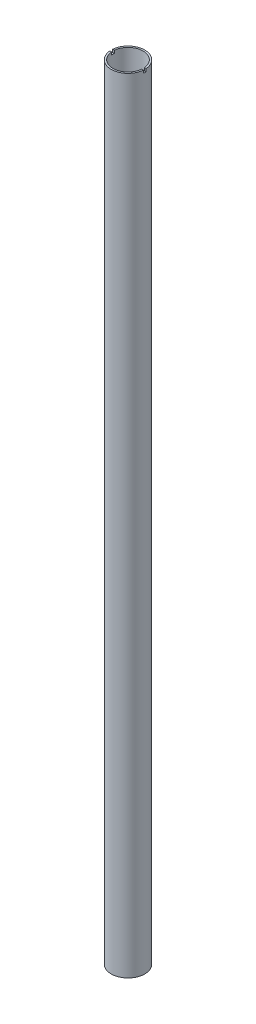
ISO-10303-21;
HEADER;
FILE_DESCRIPTION(('STEP AP214'),'2;1');
FILE_NAME('part.step','',(''),(''),'','','');
FILE_SCHEMA(('AUTOMOTIVE_DESIGN { 1 0 10303 214 1 1 1 1 }'));
ENDSEC;
DATA;
#1=APPLICATION_CONTEXT('core data for automotive mechanical design processes');
#2=APPLICATION_PROTOCOL_DEFINITION('international standard','automotive_design',2000,#1);
#3=PRODUCT_CONTEXT('',#1,'mechanical');
#4=PRODUCT('Part','Part','',(#3));
#5=PRODUCT_RELATED_PRODUCT_CATEGORY('part','',(#4));
#6=PRODUCT_DEFINITION_FORMATION('','',#4);
#7=PRODUCT_DEFINITION_CONTEXT('part definition',#1,'design');
#8=PRODUCT_DEFINITION('design','',#6,#7);
#9=PRODUCT_DEFINITION_SHAPE('','',#8);
#10=(LENGTH_UNIT() NAMED_UNIT(*) SI_UNIT(.MILLI.,.METRE.));
#11=(NAMED_UNIT(*) PLANE_ANGLE_UNIT() SI_UNIT($,.RADIAN.));
#12=(NAMED_UNIT(*) SI_UNIT($,.STERADIAN.) SOLID_ANGLE_UNIT());
#13=UNCERTAINTY_MEASURE_WITH_UNIT(LENGTH_MEASURE(1.E-05),#10,'distance_accuracy_value','');
#14=(GEOMETRIC_REPRESENTATION_CONTEXT(3) GLOBAL_UNCERTAINTY_ASSIGNED_CONTEXT((#13)) GLOBAL_UNIT_ASSIGNED_CONTEXT((#10,
#11,#12)) REPRESENTATION_CONTEXT('',''));
#15=CARTESIAN_POINT('',(0.,0.,0.));
#16=DIRECTION('',(0.,0.,1.));
#17=DIRECTION('',(1.,0.,0.));
#18=AXIS2_PLACEMENT_3D('',#15,#16,#17);
#19=CARTESIAN_POINT('',(0.,700.,0.));
#20=DIRECTION('',(0.,1.,0.));
#21=DIRECTION('',(0.,0.,1.));
#22=AXIS2_PLACEMENT_3D('',#19,#20,#21);
#23=PLANE('',#22);
#24=DIRECTION('',(1.,0.,0.));
#25=VECTOR('',#24,1.);
#26=CARTESIAN_POINT('',(-15.,700.,1.25));
#27=LINE('',#26,#25);
#28=CARTESIAN_POINT('',(-14.9478259288767,700.,1.25));
#29=VERTEX_POINT('',#28);
#30=CARTESIAN_POINT('',(-13.4420050587701,700.,1.25));
#31=VERTEX_POINT('',#30);
#32=EDGE_CURVE('E168',#29,#31,#27,.T.);
#33=ORIENTED_EDGE('',*,*,#32,.F.);
#34=CARTESIAN_POINT('',(0.,700.,0.));
#35=DIRECTION('',(0.,1.,0.));
#36=DIRECTION('',(0.,0.,1.));
#37=AXIS2_PLACEMENT_3D('',#34,#35,#36);
#38=CIRCLE('',#37,15.);
#39=CARTESIAN_POINT('',(14.9478259288767,700.,1.25));
#40=VERTEX_POINT('',#39);
#41=EDGE_CURVE('E121',#29,#40,#38,.T.);
#42=ORIENTED_EDGE('',*,*,#41,.T.);
#43=CARTESIAN_POINT('',(13.4420050587701,700.,1.25));
#44=VERTEX_POINT('',#43);
#45=EDGE_CURVE('E114',#44,#40,#27,.T.);
#46=ORIENTED_EDGE('',*,*,#45,.F.);
#47=CARTESIAN_POINT('',(0.,700.,0.));
#48=DIRECTION('',(0.,1.,0.));
#49=DIRECTION('',(0.,0.,1.));
#50=AXIS2_PLACEMENT_3D('',#47,#48,#49);
#51=CIRCLE('',#50,13.5);
#52=EDGE_CURVE('E154',#31,#44,#51,.T.);
#53=ORIENTED_EDGE('',*,*,#52,.F.);
#54=EDGE_LOOP('',(#33,#42,#46,#53));
#55=FACE_BOUND('',#54,.T.);
#56=ADVANCED_FACE('F33',(#55),#23,.T.);
#57=DIRECTION('',(-1.,0.,0.));
#58=VECTOR('',#57,1.);
#59=CARTESIAN_POINT('',(-15.,700.,-1.25));
#60=LINE('',#59,#58);
#61=CARTESIAN_POINT('',(14.9478259288767,700.,-1.25));
#62=VERTEX_POINT('',#61);
#63=CARTESIAN_POINT('',(13.4420050587701,700.,-1.25));
#64=VERTEX_POINT('',#63);
#65=EDGE_CURVE('E99',#62,#64,#60,.T.);
#66=ORIENTED_EDGE('',*,*,#65,.F.);
#67=CARTESIAN_POINT('',(-14.9478259288767,700.,-1.25));
#68=VERTEX_POINT('',#67);
#69=EDGE_CURVE('E111',#62,#68,#38,.T.);
#70=ORIENTED_EDGE('',*,*,#69,.T.);
#71=CARTESIAN_POINT('',(-13.4420050587701,700.,-1.25));
#72=VERTEX_POINT('',#71);
#73=EDGE_CURVE('E115',#72,#68,#60,.T.);
#74=ORIENTED_EDGE('',*,*,#73,.F.);
#75=EDGE_CURVE('E113',#64,#72,#51,.T.);
#76=ORIENTED_EDGE('',*,*,#75,.F.);
#77=EDGE_LOOP('',(#66,#70,#74,#76));
#78=FACE_BOUND('',#77,.T.);
#79=ADVANCED_FACE('F109',(#78),#23,.T.);
#80=CARTESIAN_POINT('',(0.,0.,0.));
#81=DIRECTION('',(0.,1.,0.));
#82=DIRECTION('',(0.,0.,1.));
#83=AXIS2_PLACEMENT_3D('',#80,#81,#82);
#84=PLANE('',#83);
#85=CARTESIAN_POINT('',(0.,0.,0.));
#86=DIRECTION('',(0.,1.,0.));
#87=DIRECTION('',(0.,0.,1.));
#88=AXIS2_PLACEMENT_3D('',#85,#86,#87);
#89=CIRCLE('',#88,15.);
#90=CARTESIAN_POINT('',(0.,0.,15.));
#91=VERTEX_POINT('',#90);
#92=EDGE_CURVE('E127',#91,#91,#89,.T.);
#93=ORIENTED_EDGE('',*,*,#92,.F.);
#94=EDGE_LOOP('',(#93));
#95=FACE_BOUND('',#94,.T.);
#96=CARTESIAN_POINT('',(0.,0.,0.));
#97=DIRECTION('',(0.,1.,0.));
#98=DIRECTION('',(0.,0.,1.));
#99=AXIS2_PLACEMENT_3D('',#96,#97,#98);
#100=CIRCLE('',#99,13.5);
#101=CARTESIAN_POINT('',(0.,0.,13.5));
#102=VERTEX_POINT('',#101);
#103=EDGE_CURVE('E130',#102,#102,#100,.T.);
#104=ORIENTED_EDGE('',*,*,#103,.T.);
#105=EDGE_LOOP('',(#104));
#106=FACE_BOUND('',#105,.T.);
#107=ADVANCED_FACE('F195',(#95,#106),#84,.F.);
#108=CARTESIAN_POINT('',(0.,700.,0.));
#109=DIRECTION('',(0.,-1.,0.));
#110=DIRECTION('',(0.,0.,-1.));
#111=AXIS2_PLACEMENT_3D('',#108,#109,#110);
#112=CYLINDRICAL_SURFACE('',#111,15.);
#113=CARTESIAN_POINT('',(0.,697.5,0.));
#114=DIRECTION('',(0.,-1.,0.));
#115=DIRECTION('',(0.,0.,-1.));
#116=AXIS2_PLACEMENT_3D('',#113,#114,#115);
#117=CIRCLE('',#116,15.);
#118=CARTESIAN_POINT('',(14.9478259288767,697.5,-1.25));
#119=VERTEX_POINT('',#118);
#120=CARTESIAN_POINT('',(14.9478259288767,697.5,1.25));
#121=VERTEX_POINT('',#120);
#122=EDGE_CURVE('E165',#119,#121,#117,.T.);
#123=ORIENTED_EDGE('',*,*,#122,.T.);
#124=DIRECTION('',(0.,-1.,0.));
#125=VECTOR('',#124,1.);
#126=CARTESIAN_POINT('',(14.9478259288767,700.,1.25));
#127=LINE('',#126,#125);
#128=EDGE_CURVE('E103',#121,#40,#127,.F.);
#129=ORIENTED_EDGE('',*,*,#128,.T.);
#130=ORIENTED_EDGE('',*,*,#41,.F.);
#131=DIRECTION('',(0.,-1.,0.));
#132=VECTOR('',#131,1.);
#133=CARTESIAN_POINT('',(-14.9478259288767,700.,1.25));
#134=LINE('',#133,#132);
#135=CARTESIAN_POINT('',(-14.9478259288767,697.5,1.25));
#136=VERTEX_POINT('',#135);
#137=EDGE_CURVE('E159',#29,#136,#134,.T.);
#138=ORIENTED_EDGE('',*,*,#137,.T.);
#139=CARTESIAN_POINT('',(-14.9478259288767,697.5,-1.25));
#140=VERTEX_POINT('',#139);
#141=EDGE_CURVE('E167',#136,#140,#117,.T.);
#142=ORIENTED_EDGE('',*,*,#141,.T.);
#143=DIRECTION('',(0.,-1.,0.));
#144=VECTOR('',#143,1.);
#145=CARTESIAN_POINT('',(-14.9478259288767,700.,-1.25));
#146=LINE('',#145,#144);
#147=EDGE_CURVE('E104',#140,#68,#146,.F.);
#148=ORIENTED_EDGE('',*,*,#147,.T.);
#149=ORIENTED_EDGE('',*,*,#69,.F.);
#150=DIRECTION('',(0.,-1.,0.));
#151=VECTOR('',#150,1.);
#152=CARTESIAN_POINT('',(14.9478259288767,700.,-1.25));
#153=LINE('',#152,#151);
#154=EDGE_CURVE('E96',#62,#119,#153,.T.);
#155=ORIENTED_EDGE('',*,*,#154,.T.);
#156=EDGE_LOOP('',(#123,#129,#130,#138,#142,#148,#149,#155));
#157=FACE_BOUND('',#156,.T.);
#158=ORIENTED_EDGE('',*,*,#92,.T.);
#159=EDGE_LOOP('',(#158));
#160=FACE_BOUND('',#159,.T.);
#161=ADVANCED_FACE('F35',(#157,#160),#112,.T.);
#162=CARTESIAN_POINT('',(0.,700.,0.));
#163=DIRECTION('',(0.,-1.,0.));
#164=DIRECTION('',(0.,0.,-1.));
#165=AXIS2_PLACEMENT_3D('',#162,#163,#164);
#166=CYLINDRICAL_SURFACE('',#165,13.5);
#167=DIRECTION('',(0.,-1.,0.));
#168=VECTOR('',#167,1.);
#169=CARTESIAN_POINT('',(13.4420050587701,700.,1.25));
#170=LINE('',#169,#168);
#171=CARTESIAN_POINT('',(13.4420050587701,697.5,1.25));
#172=VERTEX_POINT('',#171);
#173=EDGE_CURVE('E11',#172,#44,#170,.F.);
#174=ORIENTED_EDGE('',*,*,#173,.F.);
#175=CARTESIAN_POINT('',(0.,697.5,0.));
#176=DIRECTION('',(0.,-1.,0.));
#177=DIRECTION('',(0.,0.,-1.));
#178=AXIS2_PLACEMENT_3D('',#175,#176,#177);
#179=CIRCLE('',#178,13.5);
#180=CARTESIAN_POINT('',(13.4420050587701,697.5,-1.25));
#181=VERTEX_POINT('',#180);
#182=EDGE_CURVE('E125',#181,#172,#179,.T.);
#183=ORIENTED_EDGE('',*,*,#182,.F.);
#184=DIRECTION('',(0.,-1.,0.));
#185=VECTOR('',#184,1.);
#186=CARTESIAN_POINT('',(13.4420050587701,700.,-1.25));
#187=LINE('',#186,#185);
#188=EDGE_CURVE('E41',#64,#181,#187,.T.);
#189=ORIENTED_EDGE('',*,*,#188,.F.);
#190=ORIENTED_EDGE('',*,*,#75,.T.);
#191=DIRECTION('',(0.,-1.,0.));
#192=VECTOR('',#191,1.);
#193=CARTESIAN_POINT('',(-13.4420050587701,700.,-1.25));
#194=LINE('',#193,#192);
#195=CARTESIAN_POINT('',(-13.4420050587701,697.5,-1.25));
#196=VERTEX_POINT('',#195);
#197=EDGE_CURVE('E123',#196,#72,#194,.F.);
#198=ORIENTED_EDGE('',*,*,#197,.F.);
#199=CARTESIAN_POINT('',(-13.4420050587701,697.5,1.25));
#200=VERTEX_POINT('',#199);
#201=EDGE_CURVE('E120',#200,#196,#179,.T.);
#202=ORIENTED_EDGE('',*,*,#201,.F.);
#203=DIRECTION('',(0.,-1.,0.));
#204=VECTOR('',#203,1.);
#205=CARTESIAN_POINT('',(-13.4420050587701,700.,1.25));
#206=LINE('',#205,#204);
#207=EDGE_CURVE('E135',#31,#200,#206,.T.);
#208=ORIENTED_EDGE('',*,*,#207,.F.);
#209=ORIENTED_EDGE('',*,*,#52,.T.);
#210=EDGE_LOOP('',(#174,#183,#189,#190,#198,#202,#208,#209));
#211=FACE_BOUND('',#210,.T.);
#212=ORIENTED_EDGE('',*,*,#103,.F.);
#213=EDGE_LOOP('',(#212));
#214=FACE_BOUND('',#213,.T.);
#215=ADVANCED_FACE('F150',(#211,#214),#166,.F.);
#216=CARTESIAN_POINT('',(0.,697.5,0.));
#217=DIRECTION('',(0.,-1.,0.));
#218=DIRECTION('',(0.,0.,-1.));
#219=AXIS2_PLACEMENT_3D('',#216,#217,#218);
#220=PLANE('',#219);
#221=DIRECTION('',(1.,0.,0.));
#222=VECTOR('',#221,1.);
#223=CARTESIAN_POINT('',(-15.,697.5,1.25));
#224=LINE('',#223,#222);
#225=EDGE_CURVE('E56',#136,#200,#224,.T.);
#226=ORIENTED_EDGE('',*,*,#225,.T.);
#227=ORIENTED_EDGE('',*,*,#201,.T.);
#228=DIRECTION('',(-1.,0.,0.));
#229=VECTOR('',#228,1.);
#230=CARTESIAN_POINT('',(-15.,697.5,-1.25));
#231=LINE('',#230,#229);
#232=EDGE_CURVE('E170',#196,#140,#231,.T.);
#233=ORIENTED_EDGE('',*,*,#232,.T.);
#234=ORIENTED_EDGE('',*,*,#141,.F.);
#235=EDGE_LOOP('',(#226,#227,#233,#234));
#236=FACE_BOUND('',#235,.T.);
#237=ADVANCED_FACE('F179',(#236),#220,.F.);
#238=CARTESIAN_POINT('',(-15.,697.5,-1.25));
#239=DIRECTION('',(0.,0.,-1.));
#240=DIRECTION('',(-1.,0.,0.));
#241=AXIS2_PLACEMENT_3D('',#238,#239,#240);
#242=PLANE('',#241);
#243=ORIENTED_EDGE('',*,*,#232,.F.);
#244=ORIENTED_EDGE('',*,*,#197,.T.);
#245=ORIENTED_EDGE('',*,*,#73,.T.);
#246=ORIENTED_EDGE('',*,*,#147,.F.);
#247=EDGE_LOOP('',(#243,#244,#245,#246));
#248=FACE_BOUND('',#247,.T.);
#249=ADVANCED_FACE('F177',(#248),#242,.F.);
#250=CARTESIAN_POINT('',(-15.,697.5,1.25));
#251=DIRECTION('',(0.,0.,1.));
#252=DIRECTION('',(1.,0.,0.));
#253=AXIS2_PLACEMENT_3D('',#250,#251,#252);
#254=PLANE('',#253);
#255=ORIENTED_EDGE('',*,*,#32,.T.);
#256=ORIENTED_EDGE('',*,*,#207,.T.);
#257=ORIENTED_EDGE('',*,*,#225,.F.);
#258=ORIENTED_EDGE('',*,*,#137,.F.);
#259=EDGE_LOOP('',(#255,#256,#257,#258));
#260=FACE_BOUND('',#259,.T.);
#261=ADVANCED_FACE('F174',(#260),#254,.F.);
#262=EDGE_CURVE('E140',#172,#121,#224,.T.);
#263=ORIENTED_EDGE('',*,*,#262,.F.);
#264=ORIENTED_EDGE('',*,*,#173,.T.);
#265=ORIENTED_EDGE('',*,*,#45,.T.);
#266=ORIENTED_EDGE('',*,*,#128,.F.);
#267=EDGE_LOOP('',(#263,#264,#265,#266));
#268=FACE_BOUND('',#267,.T.);
#269=ADVANCED_FACE('F145',(#268),#254,.F.);
#270=ORIENTED_EDGE('',*,*,#65,.T.);
#271=ORIENTED_EDGE('',*,*,#188,.T.);
#272=EDGE_CURVE('E48',#119,#181,#231,.T.);
#273=ORIENTED_EDGE('',*,*,#272,.F.);
#274=ORIENTED_EDGE('',*,*,#154,.F.);
#275=EDGE_LOOP('',(#270,#271,#273,#274));
#276=FACE_BOUND('',#275,.T.);
#277=ADVANCED_FACE('F98',(#276),#242,.F.);
#278=ORIENTED_EDGE('',*,*,#272,.T.);
#279=ORIENTED_EDGE('',*,*,#182,.T.);
#280=ORIENTED_EDGE('',*,*,#262,.T.);
#281=ORIENTED_EDGE('',*,*,#122,.F.);
#282=EDGE_LOOP('',(#278,#279,#280,#281));
#283=FACE_BOUND('',#282,.T.);
#284=ADVANCED_FACE('F139',(#283),#220,.F.);
#285=CLOSED_SHELL('',(#56,#79,#107,#161,#215,#237,#249,#261,#269,#277,#284));
#286=MANIFOLD_SOLID_BREP('B2',#285);
#287=ADVANCED_BREP_SHAPE_REPRESENTATION('',(#18,#286),#14);
#288=SHAPE_DEFINITION_REPRESENTATION(#9,#287);
ENDSEC;
END-ISO-10303-21;
